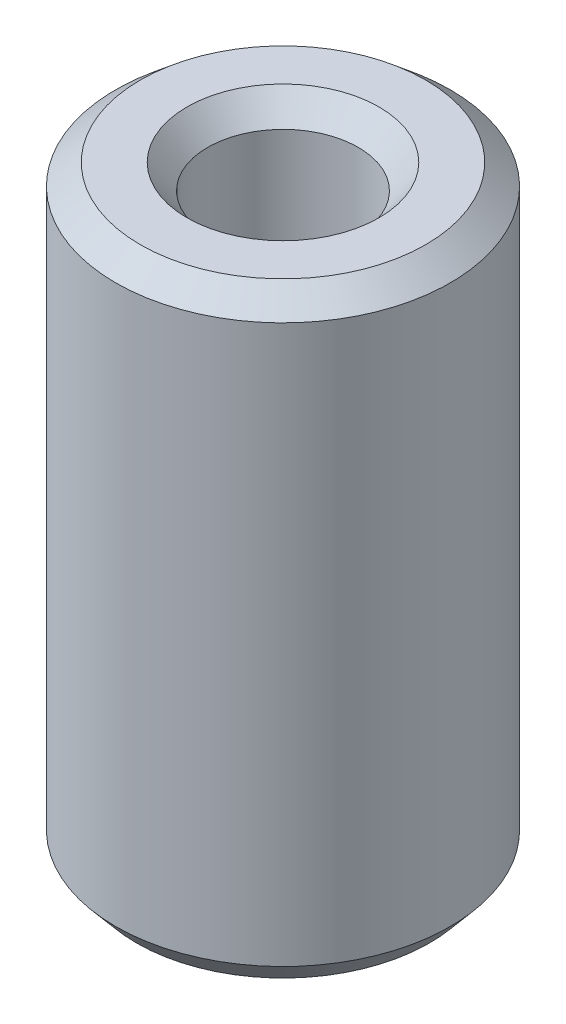
ISO-10303-21;
HEADER;
FILE_DESCRIPTION(('STEP AP214'),'2;1');
FILE_NAME('part.step','',(''),(''),'','','');
FILE_SCHEMA(('AUTOMOTIVE_DESIGN { 1 0 10303 214 1 1 1 1 }'));
ENDSEC;
DATA;
#1=APPLICATION_CONTEXT('core data for automotive mechanical design processes');
#2=APPLICATION_PROTOCOL_DEFINITION('international standard','automotive_design',2000,#1);
#3=PRODUCT_CONTEXT('',#1,'mechanical');
#4=PRODUCT('Part','Part','',(#3));
#5=PRODUCT_RELATED_PRODUCT_CATEGORY('part','',(#4));
#6=PRODUCT_DEFINITION_FORMATION('','',#4);
#7=PRODUCT_DEFINITION_CONTEXT('part definition',#1,'design');
#8=PRODUCT_DEFINITION('design','',#6,#7);
#9=PRODUCT_DEFINITION_SHAPE('','',#8);
#10=(LENGTH_UNIT() NAMED_UNIT(*) SI_UNIT(.MILLI.,.METRE.));
#11=(NAMED_UNIT(*) PLANE_ANGLE_UNIT() SI_UNIT($,.RADIAN.));
#12=(NAMED_UNIT(*) SI_UNIT($,.STERADIAN.) SOLID_ANGLE_UNIT());
#13=UNCERTAINTY_MEASURE_WITH_UNIT(LENGTH_MEASURE(1.E-05),#10,'distance_accuracy_value','');
#14=(GEOMETRIC_REPRESENTATION_CONTEXT(3) GLOBAL_UNCERTAINTY_ASSIGNED_CONTEXT((#13)) GLOBAL_UNIT_ASSIGNED_CONTEXT((#10,
#11,#12)) REPRESENTATION_CONTEXT('',''));
#15=CARTESIAN_POINT('',(0.,0.,0.));
#16=DIRECTION('',(0.,0.,1.));
#17=DIRECTION('',(1.,0.,0.));
#18=AXIS2_PLACEMENT_3D('',#15,#16,#17);
#19=CARTESIAN_POINT('',(0.,18.0155070333109,0.));
#20=DIRECTION('',(0.,-1.,0.));
#21=DIRECTION('',(0.,0.,-1.));
#22=AXIS2_PLACEMENT_3D('',#19,#20,#21);
#23=CYLINDRICAL_SURFACE('',#22,5.);
#24=CARTESIAN_POINT('',(0.,0.736134520105396,0.));
#25=DIRECTION('',(0.,1.,0.));
#26=DIRECTION('',(0.,0.,1.));
#27=AXIS2_PLACEMENT_3D('',#24,#25,#26);
#28=CIRCLE('',#27,5.);
#29=CARTESIAN_POINT('',(0.,0.736134520105396,5.));
#30=VERTEX_POINT('',#29);
#31=EDGE_CURVE('E10',#30,#30,#28,.T.);
#32=ORIENTED_EDGE('',*,*,#31,.T.);
#33=EDGE_LOOP('',(#32));
#34=FACE_BOUND('',#33,.T.);
#35=CARTESIAN_POINT('',(0.,17.396114268131,0.));
#36=DIRECTION('',(0.,1.,0.));
#37=DIRECTION('',(0.,0.,1.));
#38=AXIS2_PLACEMENT_3D('',#35,#36,#37);
#39=CIRCLE('',#38,5.);
#40=CARTESIAN_POINT('',(0.,17.396114268131,5.));
#41=VERTEX_POINT('',#40);
#42=EDGE_CURVE('E50',#41,#41,#39,.F.);
#43=ORIENTED_EDGE('',*,*,#42,.T.);
#44=EDGE_LOOP('',(#43));
#45=FACE_BOUND('',#44,.T.);
#46=ADVANCED_FACE('F39',(#34,#45),#23,.T.);
#47=CARTESIAN_POINT('',(0.,18.0155070333109,0.));
#48=DIRECTION('',(0.,1.,0.));
#49=DIRECTION('',(0.,0.,1.));
#50=AXIS2_PLACEMENT_3D('',#47,#48,#49);
#51=PLANE('',#50);
#52=CARTESIAN_POINT('',(0.,18.0155070333109,0.));
#53=DIRECTION('',(0.,1.,0.));
#54=DIRECTION('',(0.,0.,1.));
#55=AXIS2_PLACEMENT_3D('',#52,#53,#54);
#56=CIRCLE('',#55,2.8700411671819);
#57=CARTESIAN_POINT('',(0.,18.0155070333109,2.8700411671819));
#58=VERTEX_POINT('',#57);
#59=EDGE_CURVE('E58',#58,#58,#56,.F.);
#60=ORIENTED_EDGE('',*,*,#59,.T.);
#61=EDGE_LOOP('',(#60));
#62=FACE_BOUND('',#61,.T.);
#63=CARTESIAN_POINT('',(0.,18.0155070333109,0.));
#64=DIRECTION('',(0.,1.,0.));
#65=DIRECTION('',(0.,0.,1.));
#66=AXIS2_PLACEMENT_3D('',#63,#64,#65);
#67=CIRCLE('',#66,4.26386547989461);
#68=CARTESIAN_POINT('',(0.,18.0155070333109,4.26386547989461));
#69=VERTEX_POINT('',#68);
#70=EDGE_CURVE('E61',#69,#69,#67,.T.);
#71=ORIENTED_EDGE('',*,*,#70,.T.);
#72=EDGE_LOOP('',(#71));
#73=FACE_BOUND('',#72,.T.);
#74=ADVANCED_FACE('F88',(#62,#73),#51,.T.);
#75=CARTESIAN_POINT('',(0.,0.,0.));
#76=DIRECTION('',(0.,1.,0.));
#77=DIRECTION('',(0.,0.,1.));
#78=AXIS2_PLACEMENT_3D('',#75,#76,#77);
#79=PLANE('',#78);
#80=CARTESIAN_POINT('',(0.,0.,0.));
#81=DIRECTION('',(0.,1.,0.));
#82=DIRECTION('',(0.,0.,1.));
#83=AXIS2_PLACEMENT_3D('',#80,#81,#82);
#84=CIRCLE('',#83,2.98678292210734);
#85=CARTESIAN_POINT('',(0.,0.,2.98678292210734));
#86=VERTEX_POINT('',#85);
#87=EDGE_CURVE('E51',#86,#86,#84,.T.);
#88=ORIENTED_EDGE('',*,*,#87,.T.);
#89=EDGE_LOOP('',(#88));
#90=FACE_BOUND('',#89,.T.);
#91=CARTESIAN_POINT('',(0.,0.,0.));
#92=DIRECTION('',(0.,1.,0.));
#93=DIRECTION('',(0.,0.,1.));
#94=AXIS2_PLACEMENT_3D('',#91,#92,#93);
#95=CIRCLE('',#94,4.38060723482005);
#96=CARTESIAN_POINT('',(0.,0.,4.38060723482005));
#97=VERTEX_POINT('',#96);
#98=EDGE_CURVE('E54',#97,#97,#95,.F.);
#99=ORIENTED_EDGE('',*,*,#98,.T.);
#100=EDGE_LOOP('',(#99));
#101=FACE_BOUND('',#100,.T.);
#102=ADVANCED_FACE('F83',(#90,#101),#79,.F.);
#103=CARTESIAN_POINT('',(0.,18.0155070333109,0.));
#104=DIRECTION('',(0.,-1.,0.));
#105=DIRECTION('',(0.,0.,-1.));
#106=AXIS2_PLACEMENT_3D('',#103,#104,#105);
#107=CYLINDRICAL_SURFACE('',#106,2.25064840200195);
#108=CARTESIAN_POINT('',(0.,17.2793725132056,0.));
#109=DIRECTION('',(0.,1.,0.));
#110=DIRECTION('',(0.,0.,1.));
#111=AXIS2_PLACEMENT_3D('',#108,#109,#110);
#112=CIRCLE('',#111,2.25064840200195);
#113=CARTESIAN_POINT('',(0.,17.2793725132056,2.25064840200195));
#114=VERTEX_POINT('',#113);
#115=EDGE_CURVE('E67',#114,#114,#112,.T.);
#116=ORIENTED_EDGE('',*,*,#115,.T.);
#117=EDGE_LOOP('',(#116));
#118=FACE_BOUND('',#117,.T.);
#119=CARTESIAN_POINT('',(0.,0.619392765179947,0.));
#120=DIRECTION('',(0.,1.,0.));
#121=DIRECTION('',(0.,0.,1.));
#122=AXIS2_PLACEMENT_3D('',#119,#120,#121);
#123=CIRCLE('',#122,2.25064840200195);
#124=CARTESIAN_POINT('',(0.,0.619392765179947,2.25064840200195));
#125=VERTEX_POINT('',#124);
#126=EDGE_CURVE('E69',#125,#125,#123,.F.);
#127=ORIENTED_EDGE('',*,*,#126,.T.);
#128=EDGE_LOOP('',(#127));
#129=FACE_BOUND('',#128,.T.);
#130=ADVANCED_FACE('F71',(#118,#129),#107,.F.);
#131=CARTESIAN_POINT('',(0.,17.2793725132056,0.));
#132=DIRECTION('',(0.,1.,0.));
#133=DIRECTION('',(0.,0.,1.));
#134=AXIS2_PLACEMENT_3D('',#131,#132,#133);
#135=CONICAL_SURFACE('',#134,2.25064840200195,0.699487385869267);
#136=ORIENTED_EDGE('',*,*,#59,.F.);
#137=EDGE_LOOP('',(#136));
#138=FACE_BOUND('',#137,.T.);
#139=ORIENTED_EDGE('',*,*,#115,.F.);
#140=EDGE_LOOP('',(#139));
#141=FACE_BOUND('',#140,.T.);
#142=ADVANCED_FACE('F77',(#138,#141),#135,.F.);
#143=CARTESIAN_POINT('',(0.,0.,0.));
#144=DIRECTION('',(0.,-1.,0.));
#145=DIRECTION('',(0.,0.,-1.));
#146=AXIS2_PLACEMENT_3D('',#143,#144,#145);
#147=CONICAL_SURFACE('',#146,2.98678292210734,0.871308940925635);
#148=ORIENTED_EDGE('',*,*,#126,.F.);
#149=EDGE_LOOP('',(#148));
#150=FACE_BOUND('',#149,.T.);
#151=ORIENTED_EDGE('',*,*,#87,.F.);
#152=EDGE_LOOP('',(#151));
#153=FACE_BOUND('',#152,.T.);
#154=ADVANCED_FACE('F73',(#150,#153),#147,.F.);
#155=CARTESIAN_POINT('',(0.,0.736134520105396,0.));
#156=DIRECTION('',(0.,1.,0.));
#157=DIRECTION('',(0.,0.,1.));
#158=AXIS2_PLACEMENT_3D('',#155,#156,#157);
#159=CONICAL_SURFACE('',#158,5.,0.699487385869264);
#160=ORIENTED_EDGE('',*,*,#98,.F.);
#161=EDGE_LOOP('',(#160));
#162=FACE_BOUND('',#161,.T.);
#163=ORIENTED_EDGE('',*,*,#31,.F.);
#164=EDGE_LOOP('',(#163));
#165=FACE_BOUND('',#164,.T.);
#166=ADVANCED_FACE('F76',(#162,#165),#159,.T.);
#167=CARTESIAN_POINT('',(0.,18.0155070333109,0.));
#168=DIRECTION('',(0.,-1.,0.));
#169=DIRECTION('',(0.,0.,-1.));
#170=AXIS2_PLACEMENT_3D('',#167,#168,#169);
#171=CONICAL_SURFACE('',#170,4.26386547989461,0.871308940925637);
#172=ORIENTED_EDGE('',*,*,#42,.F.);
#173=EDGE_LOOP('',(#172));
#174=FACE_BOUND('',#173,.T.);
#175=ORIENTED_EDGE('',*,*,#70,.F.);
#176=EDGE_LOOP('',(#175));
#177=FACE_BOUND('',#176,.T.);
#178=ADVANCED_FACE('F45',(#174,#177),#171,.T.);
#179=CLOSED_SHELL('',(#46,#74,#102,#130,#142,#154,#166,#178));
#180=MANIFOLD_SOLID_BREP('B2',#179);
#181=ADVANCED_BREP_SHAPE_REPRESENTATION('',(#18,#180),#14);
#182=SHAPE_DEFINITION_REPRESENTATION(#9,#181);
ENDSEC;
END-ISO-10303-21;
